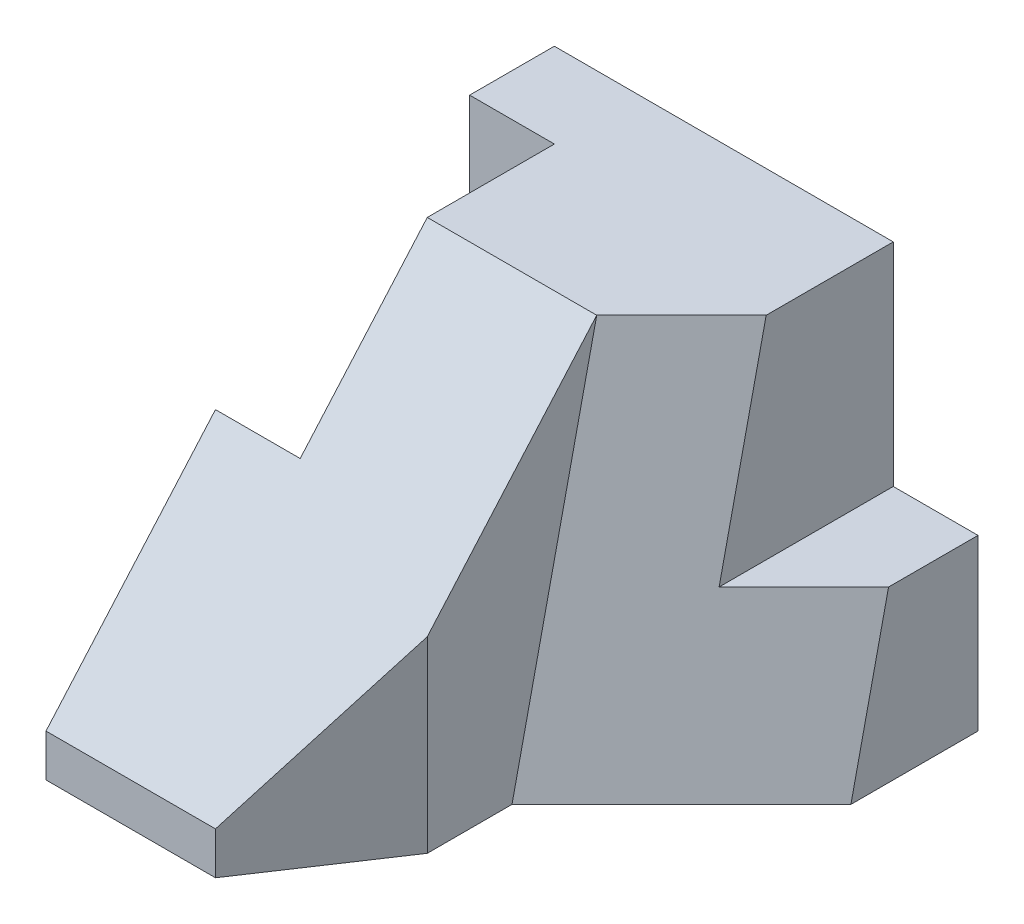
ISO-10303-21;
HEADER;
FILE_DESCRIPTION(('STEP AP214'),'2;1');
FILE_NAME('part.step','',(''),(''),'','','');
FILE_SCHEMA(('AUTOMOTIVE_DESIGN { 1 0 10303 214 1 1 1 1 }'));
ENDSEC;
DATA;
#1=APPLICATION_CONTEXT('core data for automotive mechanical design processes');
#2=APPLICATION_PROTOCOL_DEFINITION('international standard','automotive_design',2000,#1);
#3=PRODUCT_CONTEXT('',#1,'mechanical');
#4=PRODUCT('Part','Part','',(#3));
#5=PRODUCT_RELATED_PRODUCT_CATEGORY('part','',(#4));
#6=PRODUCT_DEFINITION_FORMATION('','',#4);
#7=PRODUCT_DEFINITION_CONTEXT('part definition',#1,'design');
#8=PRODUCT_DEFINITION('design','',#6,#7);
#9=PRODUCT_DEFINITION_SHAPE('','',#8);
#10=(LENGTH_UNIT() NAMED_UNIT(*) SI_UNIT(.MILLI.,.METRE.));
#11=(NAMED_UNIT(*) PLANE_ANGLE_UNIT() SI_UNIT($,.RADIAN.));
#12=(NAMED_UNIT(*) SI_UNIT($,.STERADIAN.) SOLID_ANGLE_UNIT());
#13=UNCERTAINTY_MEASURE_WITH_UNIT(LENGTH_MEASURE(1.E-05),#10,'distance_accuracy_value','');
#14=(GEOMETRIC_REPRESENTATION_CONTEXT(3) GLOBAL_UNCERTAINTY_ASSIGNED_CONTEXT((#13)) GLOBAL_UNIT_ASSIGNED_CONTEXT((#10,
#11,#12)) REPRESENTATION_CONTEXT('',''));
#15=CARTESIAN_POINT('',(0.,0.,0.));
#16=DIRECTION('',(0.,0.,1.));
#17=DIRECTION('',(1.,0.,0.));
#18=AXIS2_PLACEMENT_3D('',#15,#16,#17);
#19=CARTESIAN_POINT('',(60.,10.,20.));
#20=DIRECTION('',(1.,0.,0.));
#21=DIRECTION('',(0.,0.,-1.));
#22=AXIS2_PLACEMENT_3D('',#19,#20,#21);
#23=PLANE('',#22);
#24=DIRECTION('',(0.,0.752576694706878,-0.658504607868518));
#25=VECTOR('',#24,1.);
#26=CARTESIAN_POINT('',(60.,90.,0.));
#27=LINE('',#26,#25);
#28=CARTESIAN_POINT('',(60.,44.2857142857143,40.));
#29=VERTEX_POINT('',#28);
#30=CARTESIAN_POINT('',(60.,90.,0.));
#31=VERTEX_POINT('',#30);
#32=EDGE_CURVE('E162',#29,#31,#27,.T.);
#33=ORIENTED_EDGE('',*,*,#32,.F.);
#34=DIRECTION('',(0.,-1.,0.));
#35=VECTOR('',#34,1.);
#36=CARTESIAN_POINT('',(60.,10.,40.));
#37=LINE('',#36,#35);
#38=CARTESIAN_POINT('',(60.,0.,40.));
#39=VERTEX_POINT('',#38);
#40=EDGE_CURVE('E145',#29,#39,#37,.T.);
#41=ORIENTED_EDGE('',*,*,#40,.T.);
#42=DIRECTION('',(0.,0.,1.));
#43=VECTOR('',#42,1.);
#44=CARTESIAN_POINT('',(60.,0.,20.));
#45=LINE('',#44,#43);
#46=CARTESIAN_POINT('',(60.,0.,20.));
#47=VERTEX_POINT('',#46);
#48=EDGE_CURVE('E200',#47,#39,#45,.T.);
#49=ORIENTED_EDGE('',*,*,#48,.F.);
#50=DIRECTION('',(0.,-0.976187060183953,0.216930457818656));
#51=VECTOR('',#50,1.);
#52=CARTESIAN_POINT('',(60.,4.23529411764706,19.0588235294118));
#53=LINE('',#52,#51);
#54=EDGE_CURVE('E169',#31,#47,#53,.T.);
#55=ORIENTED_EDGE('',*,*,#54,.F.);
#56=EDGE_LOOP('',(#33,#41,#49,#55));
#57=FACE_BOUND('',#56,.T.);
#58=ADVANCED_FACE('F36',(#57),#23,.T.);
#59=CARTESIAN_POINT('',(0.,39.0265486725663,44.6017699115044));
#60=DIRECTION('',(0.,0.658504607868518,0.752576694706878));
#61=DIRECTION('',(0.,-0.752576694706878,0.658504607868518));
#62=AXIS2_PLACEMENT_3D('',#59,#60,#61);
#63=PLANE('',#62);
#64=DIRECTION('',(-1.,0.,0.));
#65=VECTOR('',#64,1.);
#66=CARTESIAN_POINT('',(40.,10.,70.));
#67=LINE('',#66,#65);
#68=CARTESIAN_POINT('',(40.,10.,70.));
#69=VERTEX_POINT('',#68);
#70=CARTESIAN_POINT('',(0.,10.,70.));
#71=VERTEX_POINT('',#70);
#72=EDGE_CURVE('E157',#69,#71,#67,.T.);
#73=ORIENTED_EDGE('',*,*,#72,.F.);
#74=DIRECTION('',(0.40197369619415,0.689097764904257,-0.602960544291225));
#75=VECTOR('',#74,1.);
#76=CARTESIAN_POINT('',(47.7328936521022,23.2563891178895,58.4006595218467));
#77=LINE('',#76,#75);
#78=EDGE_CURVE('E148',#69,#29,#77,.T.);
#79=ORIENTED_EDGE('',*,*,#78,.T.);
#80=ORIENTED_EDGE('',*,*,#32,.T.);
#81=DIRECTION('',(1.,0.,0.));
#82=VECTOR('',#81,1.);
#83=CARTESIAN_POINT('',(0.,90.,0.));
#84=LINE('',#83,#82);
#85=CARTESIAN_POINT('',(20.,90.,0.));
#86=VERTEX_POINT('',#85);
#87=EDGE_CURVE('E248',#86,#31,#84,.T.);
#88=ORIENTED_EDGE('',*,*,#87,.F.);
#89=DIRECTION('',(0.,0.752576694706878,-0.658504607868518));
#90=VECTOR('',#89,1.);
#91=CARTESIAN_POINT('',(20.,39.0265486725663,44.6017699115044));
#92=LINE('',#91,#90);
#93=CARTESIAN_POINT('',(20.,55.7142857142857,30.));
#94=VERTEX_POINT('',#93);
#95=EDGE_CURVE('E45',#94,#86,#92,.T.);
#96=ORIENTED_EDGE('',*,*,#95,.F.);
#97=DIRECTION('',(1.,0.,0.));
#98=VECTOR('',#97,1.);
#99=CARTESIAN_POINT('',(0.,55.7142857142857,30.));
#100=LINE('',#99,#98);
#101=CARTESIAN_POINT('',(0.,55.7142857142857,30.));
#102=VERTEX_POINT('',#101);
#103=EDGE_CURVE('E11',#102,#94,#100,.T.);
#104=ORIENTED_EDGE('',*,*,#103,.F.);
#105=DIRECTION('',(0.,0.752576694706878,-0.658504607868518));
#106=VECTOR('',#105,1.);
#107=CARTESIAN_POINT('',(0.,55.7142857142857,30.));
#108=LINE('',#107,#106);
#109=EDGE_CURVE('E190',#71,#102,#108,.T.);
#110=ORIENTED_EDGE('',*,*,#109,.F.);
#111=EDGE_LOOP('',(#73,#79,#80,#88,#96,#104,#110));
#112=FACE_BOUND('',#111,.T.);
#113=ADVANCED_FACE('F160',(#112),#63,.T.);
#114=CARTESIAN_POINT('',(0.,90.,0.));
#115=DIRECTION('',(1.,0.,0.));
#116=DIRECTION('',(0.,0.,-1.));
#117=AXIS2_PLACEMENT_3D('',#114,#115,#116);
#118=PLANE('',#117);
#119=ORIENTED_EDGE('',*,*,#109,.T.);
#120=DIRECTION('',(0.,-1.,0.));
#121=VECTOR('',#120,1.);
#122=CARTESIAN_POINT('',(0.,152.,30.));
#123=LINE('',#122,#121);
#124=CARTESIAN_POINT('',(0.,0.,30.));
#125=VERTEX_POINT('',#124);
#126=EDGE_CURVE('E187',#102,#125,#123,.T.);
#127=ORIENTED_EDGE('',*,*,#126,.T.);
#128=DIRECTION('',(0.,0.,1.));
#129=VECTOR('',#128,1.);
#130=CARTESIAN_POINT('',(0.,0.,0.));
#131=LINE('',#130,#129);
#132=CARTESIAN_POINT('',(0.,0.,70.));
#133=VERTEX_POINT('',#132);
#134=EDGE_CURVE('E243',#125,#133,#131,.T.);
#135=ORIENTED_EDGE('',*,*,#134,.T.);
#136=DIRECTION('',(0.,-1.,0.));
#137=VECTOR('',#136,1.);
#138=CARTESIAN_POINT('',(0.,10.,70.));
#139=LINE('',#138,#137);
#140=EDGE_CURVE('E210',#71,#133,#139,.T.);
#141=ORIENTED_EDGE('',*,*,#140,.F.);
#142=EDGE_LOOP('',(#119,#127,#135,#141));
#143=FACE_BOUND('',#142,.T.);
#144=ADVANCED_FACE('F295',(#143),#118,.F.);
#145=CARTESIAN_POINT('',(0.,0.,-30.));
#146=DIRECTION('',(0.,0.,-1.));
#147=DIRECTION('',(-1.,0.,0.));
#148=AXIS2_PLACEMENT_3D('',#145,#146,#147);
#149=PLANE('',#148);
#150=DIRECTION('',(0.,1.,0.));
#151=VECTOR('',#150,1.);
#152=CARTESIAN_POINT('',(0.,0.,-30.));
#153=LINE('',#152,#151);
#154=CARTESIAN_POINT('',(0.,0.,-30.));
#155=VERTEX_POINT('',#154);
#156=CARTESIAN_POINT('',(0.,90.,-30.));
#157=VERTEX_POINT('',#156);
#158=EDGE_CURVE('E241',#155,#157,#153,.T.);
#159=ORIENTED_EDGE('',*,*,#158,.F.);
#160=DIRECTION('',(1.,0.,0.));
#161=VECTOR('',#160,1.);
#162=CARTESIAN_POINT('',(0.,0.,-30.));
#163=LINE('',#162,#161);
#164=CARTESIAN_POINT('',(20.,0.,-30.));
#165=VERTEX_POINT('',#164);
#166=EDGE_CURVE('E180',#155,#165,#163,.T.);
#167=ORIENTED_EDGE('',*,*,#166,.T.);
#168=DIRECTION('',(0.,1.,0.));
#169=VECTOR('',#168,1.);
#170=CARTESIAN_POINT('',(20.,0.,-30.));
#171=LINE('',#170,#169);
#172=CARTESIAN_POINT('',(20.,90.,-30.));
#173=VERTEX_POINT('',#172);
#174=EDGE_CURVE('E240',#165,#173,#171,.T.);
#175=ORIENTED_EDGE('',*,*,#174,.T.);
#176=DIRECTION('',(-1.,0.,0.));
#177=VECTOR('',#176,1.);
#178=CARTESIAN_POINT('',(0.,90.,-30.));
#179=LINE('',#178,#177);
#180=EDGE_CURVE('E237',#173,#157,#179,.T.);
#181=ORIENTED_EDGE('',*,*,#180,.T.);
#182=EDGE_LOOP('',(#159,#167,#175,#181));
#183=FACE_BOUND('',#182,.T.);
#184=ADVANCED_FACE('F283',(#183),#149,.F.);
#185=CARTESIAN_POINT('',(0.,10.,30.));
#186=DIRECTION('',(0.,0.,-1.));
#187=DIRECTION('',(-1.,0.,0.));
#188=AXIS2_PLACEMENT_3D('',#185,#186,#187);
#189=PLANE('',#188);
#190=DIRECTION('',(0.,-1.,0.));
#191=VECTOR('',#190,1.);
#192=CARTESIAN_POINT('',(20.,112.,30.));
#193=LINE('',#192,#191);
#194=CARTESIAN_POINT('',(20.,0.,30.));
#195=VERTEX_POINT('',#194);
#196=EDGE_CURVE('E60',#94,#195,#193,.T.);
#197=ORIENTED_EDGE('',*,*,#196,.T.);
#198=DIRECTION('',(-1.,0.,0.));
#199=VECTOR('',#198,1.);
#200=CARTESIAN_POINT('',(0.,0.,30.));
#201=LINE('',#200,#199);
#202=EDGE_CURVE('E185',#195,#125,#201,.T.);
#203=ORIENTED_EDGE('',*,*,#202,.T.);
#204=ORIENTED_EDGE('',*,*,#126,.F.);
#205=ORIENTED_EDGE('',*,*,#103,.T.);
#206=EDGE_LOOP('',(#197,#203,#204,#205));
#207=FACE_BOUND('',#206,.T.);
#208=ADVANCED_FACE('F289',(#207),#189,.T.);
#209=CARTESIAN_POINT('',(20.,0.,0.));
#210=DIRECTION('',(1.,0.,0.));
#211=DIRECTION('',(0.,0.,-1.));
#212=AXIS2_PLACEMENT_3D('',#209,#210,#211);
#213=PLANE('',#212);
#214=ORIENTED_EDGE('',*,*,#174,.F.);
#215=DIRECTION('',(0.,0.,1.));
#216=VECTOR('',#215,1.);
#217=CARTESIAN_POINT('',(20.,0.,-30.));
#218=LINE('',#217,#216);
#219=EDGE_CURVE('E183',#165,#195,#218,.T.);
#220=ORIENTED_EDGE('',*,*,#219,.T.);
#221=ORIENTED_EDGE('',*,*,#196,.F.);
#222=ORIENTED_EDGE('',*,*,#95,.T.);
#223=DIRECTION('',(0.,0.,-1.));
#224=VECTOR('',#223,1.);
#225=CARTESIAN_POINT('',(20.,90.,0.));
#226=LINE('',#225,#224);
#227=EDGE_CURVE('E234',#86,#173,#226,.T.);
#228=ORIENTED_EDGE('',*,*,#227,.T.);
#229=EDGE_LOOP('',(#214,#220,#221,#222,#228));
#230=FACE_BOUND('',#229,.T.);
#231=ADVANCED_FACE('F275',(#230),#213,.F.);
#232=CARTESIAN_POINT('',(0.,0.,0.));
#233=DIRECTION('',(0.,-1.,0.));
#234=DIRECTION('',(0.,0.,-1.));
#235=AXIS2_PLACEMENT_3D('',#232,#233,#234);
#236=PLANE('',#235);
#237=ORIENTED_EDGE('',*,*,#202,.F.);
#238=ORIENTED_EDGE('',*,*,#219,.F.);
#239=ORIENTED_EDGE('',*,*,#166,.F.);
#240=CARTESIAN_POINT('',(0.,0.,-50.));
#241=VERTEX_POINT('',#240);
#242=EDGE_CURVE('E256',#241,#155,#131,.T.);
#243=ORIENTED_EDGE('',*,*,#242,.F.);
#244=DIRECTION('',(-1.,0.,0.));
#245=VECTOR('',#244,1.);
#246=CARTESIAN_POINT('',(0.,0.,-50.));
#247=LINE('',#246,#245);
#248=CARTESIAN_POINT('',(100.,0.,-50.));
#249=VERTEX_POINT('',#248);
#250=EDGE_CURVE('E249',#249,#241,#247,.T.);
#251=ORIENTED_EDGE('',*,*,#250,.F.);
#252=DIRECTION('',(0.,0.,-1.));
#253=VECTOR('',#252,1.);
#254=CARTESIAN_POINT('',(100.,0.,0.));
#255=LINE('',#254,#253);
#256=CARTESIAN_POINT('',(100.,0.,-20.));
#257=VERTEX_POINT('',#256);
#258=EDGE_CURVE('E228',#257,#249,#255,.T.);
#259=ORIENTED_EDGE('',*,*,#258,.F.);
#260=DIRECTION('',(0.707106781186548,0.,-0.707106781186547));
#261=VECTOR('',#260,1.);
#262=CARTESIAN_POINT('',(60.,0.,20.));
#263=LINE('',#262,#261);
#264=EDGE_CURVE('E219',#47,#257,#263,.T.);
#265=ORIENTED_EDGE('',*,*,#264,.F.);
#266=ORIENTED_EDGE('',*,*,#48,.T.);
#267=DIRECTION('',(-0.554700196225229,0.,0.832050294337843));
#268=VECTOR('',#267,1.);
#269=CARTESIAN_POINT('',(60.,0.,40.));
#270=LINE('',#269,#268);
#271=CARTESIAN_POINT('',(40.,0.,70.));
#272=VERTEX_POINT('',#271);
#273=EDGE_CURVE('E151',#39,#272,#270,.T.);
#274=ORIENTED_EDGE('',*,*,#273,.T.);
#275=DIRECTION('',(-1.,0.,0.));
#276=VECTOR('',#275,1.);
#277=CARTESIAN_POINT('',(40.,0.,70.));
#278=LINE('',#277,#276);
#279=EDGE_CURVE('E204',#272,#133,#278,.T.);
#280=ORIENTED_EDGE('',*,*,#279,.T.);
#281=ORIENTED_EDGE('',*,*,#134,.F.);
#282=EDGE_LOOP('',(#237,#238,#239,#243,#251,#259,#265,#266,#274,#280,#281));
#283=FACE_BOUND('',#282,.T.);
#284=ADVANCED_FACE('F292',(#283),#236,.T.);
#285=CARTESIAN_POINT('',(39.0361445783132,8.67469879518072,39.0361445783133));
#286=DIRECTION('',(0.6985354731357,0.155230105141266,0.6985354731357));
#287=DIRECTION('',(0.707106781186548,0.,-0.707106781186547));
#288=AXIS2_PLACEMENT_3D('',#285,#286,#287);
#289=PLANE('',#288);
#290=DIRECTION('',(0.,-0.976187060183953,0.216930457818656));
#291=VECTOR('',#290,1.);
#292=CARTESIAN_POINT('',(80.,0.,0.));
#293=LINE('',#292,#291);
#294=CARTESIAN_POINT('',(80.,90.,-20.));
#295=VERTEX_POINT('',#294);
#296=CARTESIAN_POINT('',(80.,40.,-8.88888888888889));
#297=VERTEX_POINT('',#296);
#298=EDGE_CURVE('E167',#295,#297,#293,.T.);
#299=ORIENTED_EDGE('',*,*,#298,.F.);
#300=DIRECTION('',(-0.707106781186548,0.,0.707106781186547));
#301=VECTOR('',#300,1.);
#302=CARTESIAN_POINT('',(60.,90.,0.));
#303=LINE('',#302,#301);
#304=EDGE_CURVE('E222',#295,#31,#303,.T.);
#305=ORIENTED_EDGE('',*,*,#304,.T.);
#306=ORIENTED_EDGE('',*,*,#54,.T.);
#307=ORIENTED_EDGE('',*,*,#264,.T.);
#308=DIRECTION('',(0.,0.976187060183953,-0.216930457818656));
#309=VECTOR('',#308,1.);
#310=CARTESIAN_POINT('',(100.,0.,-20.));
#311=LINE('',#310,#309);
#312=CARTESIAN_POINT('',(100.,40.,-28.8888888888889));
#313=VERTEX_POINT('',#312);
#314=EDGE_CURVE('E216',#257,#313,#311,.T.);
#315=ORIENTED_EDGE('',*,*,#314,.T.);
#316=DIRECTION('',(-0.707106781186548,0.,0.707106781186547));
#317=VECTOR('',#316,1.);
#318=CARTESIAN_POINT('',(35.5555555555556,40.,35.5555555555556));
#319=LINE('',#318,#317);
#320=EDGE_CURVE('E213',#313,#297,#319,.T.);
#321=ORIENTED_EDGE('',*,*,#320,.T.);
#322=EDGE_LOOP('',(#299,#305,#306,#307,#315,#321));
#323=FACE_BOUND('',#322,.T.);
#324=ADVANCED_FACE('F301',(#323),#289,.T.);
#325=CARTESIAN_POINT('',(0.,90.,-50.));
#326=DIRECTION('',(0.,0.,1.));
#327=DIRECTION('',(1.,0.,0.));
#328=AXIS2_PLACEMENT_3D('',#325,#326,#327);
#329=PLANE('',#328);
#330=ORIENTED_EDGE('',*,*,#250,.T.);
#331=DIRECTION('',(0.,-1.,0.));
#332=VECTOR('',#331,1.);
#333=CARTESIAN_POINT('',(0.,90.,-50.));
#334=LINE('',#333,#332);
#335=CARTESIAN_POINT('',(0.,90.,-50.));
#336=VERTEX_POINT('',#335);
#337=EDGE_CURVE('E255',#336,#241,#334,.T.);
#338=ORIENTED_EDGE('',*,*,#337,.F.);
#339=DIRECTION('',(-1.,0.,0.));
#340=VECTOR('',#339,1.);
#341=CARTESIAN_POINT('',(0.,90.,-50.));
#342=LINE('',#341,#340);
#343=CARTESIAN_POINT('',(80.,90.,-50.));
#344=VERTEX_POINT('',#343);
#345=EDGE_CURVE('E253',#344,#336,#342,.T.);
#346=ORIENTED_EDGE('',*,*,#345,.F.);
#347=DIRECTION('',(0.,-1.,0.));
#348=VECTOR('',#347,1.);
#349=CARTESIAN_POINT('',(80.,90.,-50.));
#350=LINE('',#349,#348);
#351=CARTESIAN_POINT('',(80.,40.,-50.));
#352=VERTEX_POINT('',#351);
#353=EDGE_CURVE('E262',#344,#352,#350,.T.);
#354=ORIENTED_EDGE('',*,*,#353,.T.);
#355=DIRECTION('',(-1.,0.,0.));
#356=VECTOR('',#355,1.);
#357=CARTESIAN_POINT('',(100.,40.,-50.));
#358=LINE('',#357,#356);
#359=CARTESIAN_POINT('',(100.,40.,-50.));
#360=VERTEX_POINT('',#359);
#361=EDGE_CURVE('E233',#360,#352,#358,.T.);
#362=ORIENTED_EDGE('',*,*,#361,.F.);
#363=DIRECTION('',(0.,1.,0.));
#364=VECTOR('',#363,1.);
#365=CARTESIAN_POINT('',(100.,0.,-50.));
#366=LINE('',#365,#364);
#367=EDGE_CURVE('E231',#249,#360,#366,.T.);
#368=ORIENTED_EDGE('',*,*,#367,.F.);
#369=EDGE_LOOP('',(#330,#338,#346,#354,#362,#368));
#370=FACE_BOUND('',#369,.T.);
#371=ADVANCED_FACE('F310',(#370),#329,.F.);
#372=CARTESIAN_POINT('',(100.,0.,0.));
#373=DIRECTION('',(1.,0.,0.));
#374=DIRECTION('',(0.,0.,-1.));
#375=AXIS2_PLACEMENT_3D('',#372,#373,#374);
#376=PLANE('',#375);
#377=DIRECTION('',(0.,0.,1.));
#378=VECTOR('',#377,1.);
#379=CARTESIAN_POINT('',(100.,40.,0.));
#380=LINE('',#379,#378);
#381=EDGE_CURVE('E226',#360,#313,#380,.T.);
#382=ORIENTED_EDGE('',*,*,#381,.T.);
#383=ORIENTED_EDGE('',*,*,#314,.F.);
#384=ORIENTED_EDGE('',*,*,#258,.T.);
#385=ORIENTED_EDGE('',*,*,#367,.T.);
#386=EDGE_LOOP('',(#382,#383,#384,#385));
#387=FACE_BOUND('',#386,.T.);
#388=ADVANCED_FACE('F315',(#387),#376,.T.);
#389=CARTESIAN_POINT('',(80.,90.,0.));
#390=DIRECTION('',(-1.,0.,0.));
#391=DIRECTION('',(0.,0.,1.));
#392=AXIS2_PLACEMENT_3D('',#389,#390,#391);
#393=PLANE('',#392);
#394=DIRECTION('',(0.,0.,-1.));
#395=VECTOR('',#394,1.);
#396=CARTESIAN_POINT('',(80.,90.,0.));
#397=LINE('',#396,#395);
#398=EDGE_CURVE('E251',#295,#344,#397,.T.);
#399=ORIENTED_EDGE('',*,*,#398,.F.);
#400=ORIENTED_EDGE('',*,*,#298,.T.);
#401=DIRECTION('',(0.,0.,1.));
#402=VECTOR('',#401,1.);
#403=CARTESIAN_POINT('',(80.,40.,0.));
#404=LINE('',#403,#402);
#405=EDGE_CURVE('E225',#352,#297,#404,.T.);
#406=ORIENTED_EDGE('',*,*,#405,.F.);
#407=ORIENTED_EDGE('',*,*,#353,.F.);
#408=EDGE_LOOP('',(#399,#400,#406,#407));
#409=FACE_BOUND('',#408,.T.);
#410=ADVANCED_FACE('F305',(#409),#393,.F.);
#411=ORIENTED_EDGE('',*,*,#242,.T.);
#412=ORIENTED_EDGE('',*,*,#158,.T.);
#413=DIRECTION('',(0.,0.,1.));
#414=VECTOR('',#413,1.);
#415=CARTESIAN_POINT('',(0.,90.,0.));
#416=LINE('',#415,#414);
#417=EDGE_CURVE('E245',#336,#157,#416,.T.);
#418=ORIENTED_EDGE('',*,*,#417,.F.);
#419=ORIENTED_EDGE('',*,*,#337,.T.);
#420=EDGE_LOOP('',(#411,#412,#418,#419));
#421=FACE_BOUND('',#420,.T.);
#422=ADVANCED_FACE('F38',(#421),#118,.F.);
#423=CARTESIAN_POINT('',(0.,90.,0.));
#424=DIRECTION('',(0.,-1.,0.));
#425=DIRECTION('',(0.,0.,-1.));
#426=AXIS2_PLACEMENT_3D('',#423,#424,#425);
#427=PLANE('',#426);
#428=ORIENTED_EDGE('',*,*,#87,.T.);
#429=ORIENTED_EDGE('',*,*,#304,.F.);
#430=ORIENTED_EDGE('',*,*,#398,.T.);
#431=ORIENTED_EDGE('',*,*,#345,.T.);
#432=ORIENTED_EDGE('',*,*,#417,.T.);
#433=ORIENTED_EDGE('',*,*,#180,.F.);
#434=ORIENTED_EDGE('',*,*,#227,.F.);
#435=EDGE_LOOP('',(#428,#429,#430,#431,#432,#433,#434));
#436=FACE_BOUND('',#435,.T.);
#437=ADVANCED_FACE('F280',(#436),#427,.F.);
#438=CARTESIAN_POINT('',(100.,40.,0.));
#439=DIRECTION('',(0.,-1.,0.));
#440=DIRECTION('',(0.,0.,-1.));
#441=AXIS2_PLACEMENT_3D('',#438,#439,#440);
#442=PLANE('',#441);
#443=ORIENTED_EDGE('',*,*,#405,.T.);
#444=ORIENTED_EDGE('',*,*,#320,.F.);
#445=ORIENTED_EDGE('',*,*,#381,.F.);
#446=ORIENTED_EDGE('',*,*,#361,.T.);
#447=EDGE_LOOP('',(#443,#444,#445,#446));
#448=FACE_BOUND('',#447,.T.);
#449=ADVANCED_FACE('F319',(#448),#442,.F.);
#450=CARTESIAN_POINT('',(40.,10.,70.));
#451=DIRECTION('',(0.,0.,1.));
#452=DIRECTION('',(1.,0.,0.));
#453=AXIS2_PLACEMENT_3D('',#450,#451,#452);
#454=PLANE('',#453);
#455=ORIENTED_EDGE('',*,*,#279,.F.);
#456=DIRECTION('',(0.,-1.,0.));
#457=VECTOR('',#456,1.);
#458=CARTESIAN_POINT('',(40.,10.,70.));
#459=LINE('',#458,#457);
#460=EDGE_CURVE('E156',#69,#272,#459,.T.);
#461=ORIENTED_EDGE('',*,*,#460,.F.);
#462=ORIENTED_EDGE('',*,*,#72,.T.);
#463=ORIENTED_EDGE('',*,*,#140,.T.);
#464=EDGE_LOOP('',(#455,#461,#462,#463));
#465=FACE_BOUND('',#464,.T.);
#466=ADVANCED_FACE('F297',(#465),#454,.T.);
#467=CARTESIAN_POINT('',(60.,10.,40.));
#468=DIRECTION('',(0.832050294337843,0.,0.554700196225229));
#469=DIRECTION('',(0.554700196225229,0.,-0.832050294337843));
#470=AXIS2_PLACEMENT_3D('',#467,#468,#469);
#471=PLANE('',#470);
#472=ORIENTED_EDGE('',*,*,#273,.F.);
#473=ORIENTED_EDGE('',*,*,#40,.F.);
#474=ORIENTED_EDGE('',*,*,#78,.F.);
#475=ORIENTED_EDGE('',*,*,#460,.T.);
#476=EDGE_LOOP('',(#472,#473,#474,#475));
#477=FACE_BOUND('',#476,.T.);
#478=ADVANCED_FACE('F147',(#477),#471,.T.);
#479=CLOSED_SHELL('',(#58,#113,#144,#184,#208,#231,#284,#324,#371,#388,#410,#422,#437,#449,#466,#478));
#480=CARTESIAN_POINT('',(60.,16.247483918726,-84.2885898071704));
#481=DIRECTION('',(-0.982757328037785,0.139151480076146,-0.121757545066628));
#482=DIRECTION('',(-0.140194545388263,-0.990123976804611,0.));
#483=AXIS2_PLACEMENT_3D('',#480,#481,#482);
#484=PLANE('',#483);
#485=DIRECTION('',(-0.124031007751938,-0.984496124031008,-0.124031007751938));
#486=VECTOR('',#485,1.);
#487=CARTESIAN_POINT('',(56.0184511769776,75.8964562172595,16.0184511769775));
#488=LINE('',#487,#486);
#489=CARTESIAN_POINT('',(51.356783919598,38.8944723618093,11.356783919598));
#490=VERTEX_POINT('',#489);
#491=CARTESIAN_POINT('',(47.7165354330709,10.,7.71653543307085));
#492=VERTEX_POINT('',#491);
#493=EDGE_CURVE('E198',#490,#492,#488,.T.);
#494=ORIENTED_EDGE('',*,*,#493,.F.);
#495=DIRECTION('',(-0.162892446376314,-0.963148941655301,0.214033098145623));
#496=VECTOR('',#495,1.);
#497=CARTESIAN_POINT('',(51.3676598122278,38.9587792385794,11.3424935025379));
#498=LINE('',#497,#496);
#499=CARTESIAN_POINT('',(46.4700098328417,10.,17.7777777777778));
#500=VERTEX_POINT('',#499);
#501=EDGE_CURVE('E172',#490,#500,#498,.T.);
#502=ORIENTED_EDGE('',*,*,#501,.T.);
#503=DIRECTION('',(0.12295374891931,0.,-0.992412401991575));
#504=VECTOR('',#503,1.);
#505=CARTESIAN_POINT('',(47.9367527959892,10.,5.93906671808717));
#506=LINE('',#505,#504);
#507=EDGE_CURVE('E195',#500,#492,#506,.T.);
#508=ORIENTED_EDGE('',*,*,#507,.T.);
#509=EDGE_LOOP('',(#494,#502,#508));
#510=FACE_BOUND('',#509,.T.);
#511=ADVANCED_FACE('F421',(#510),#484,.F.);
#512=CARTESIAN_POINT('',(0.,10.,0.));
#513=DIRECTION('',(0.,-1.,0.));
#514=DIRECTION('',(0.,0.,-1.));
#515=AXIS2_PLACEMENT_3D('',#512,#513,#514);
#516=PLANE('',#515);
#517=ORIENTED_EDGE('',*,*,#507,.F.);
#518=DIRECTION('',(1.,0.,0.));
#519=VECTOR('',#518,1.);
#520=CARTESIAN_POINT('',(40.,10.,17.7777777777778));
#521=LINE('',#520,#519);
#522=CARTESIAN_POINT('',(57.7777777777778,10.,17.7777777777778));
#523=VERTEX_POINT('',#522);
#524=EDGE_CURVE('E52',#500,#523,#521,.T.);
#525=ORIENTED_EDGE('',*,*,#524,.T.);
#526=DIRECTION('',(0.707106781186547,0.,0.707106781186548));
#527=VECTOR('',#526,1.);
#528=CARTESIAN_POINT('',(40.,10.,0.));
#529=LINE('',#528,#527);
#530=EDGE_CURVE('E201',#492,#523,#529,.T.);
#531=ORIENTED_EDGE('',*,*,#530,.F.);
#532=EDGE_LOOP('',(#517,#525,#531));
#533=FACE_BOUND('',#532,.T.);
#534=ADVANCED_FACE('F343',(#533),#516,.F.);
#535=CARTESIAN_POINT('',(23.4556520208434,84.1012560046319,-16.5443479791566));
#536=DIRECTION('',(-0.707106781186548,0.,0.707106781186547));
#537=DIRECTION('',(0.707106781186547,0.,0.707106781186548));
#538=AXIS2_PLACEMENT_3D('',#535,#536,#537);
#539=PLANE('',#538);
#540=DIRECTION('',(0.211999576001272,-0.953998092005724,0.211999576001272));
#541=VECTOR('',#540,1.);
#542=CARTESIAN_POINT('',(39.7058720009368,91.3235759957845,-0.294127999063219));
#543=LINE('',#542,#541);
#544=EDGE_CURVE('E178',#490,#523,#543,.T.);
#545=ORIENTED_EDGE('',*,*,#544,.F.);
#546=ORIENTED_EDGE('',*,*,#493,.T.);
#547=ORIENTED_EDGE('',*,*,#530,.T.);
#548=EDGE_LOOP('',(#545,#546,#547));
#549=FACE_BOUND('',#548,.T.);
#550=ADVANCED_FACE('F340',(#549),#539,.T.);
#551=CARTESIAN_POINT('',(40.,10.,17.7777777777778));
#552=DIRECTION('',(0.,-0.216930457818656,-0.976187060183953));
#553=DIRECTION('',(0.,0.976187060183953,-0.216930457818656));
#554=AXIS2_PLACEMENT_3D('',#551,#552,#553);
#555=PLANE('',#554);
#556=ORIENTED_EDGE('',*,*,#501,.F.);
#557=ORIENTED_EDGE('',*,*,#544,.T.);
#558=ORIENTED_EDGE('',*,*,#524,.F.);
#559=EDGE_LOOP('',(#556,#557,#558));
#560=FACE_BOUND('',#559,.T.);
#561=ADVANCED_FACE('F342',(#560),#555,.T.);
#562=CLOSED_SHELL('',(#511,#534,#550,#561));
#563=ORIENTED_CLOSED_SHELL('',*,#562,.T.);
#564=BREP_WITH_VOIDS('B2',#479,(#563));
#565=ADVANCED_BREP_SHAPE_REPRESENTATION('',(#18,#564),#14);
#566=SHAPE_DEFINITION_REPRESENTATION(#9,#565);
ENDSEC;
END-ISO-10303-21;
